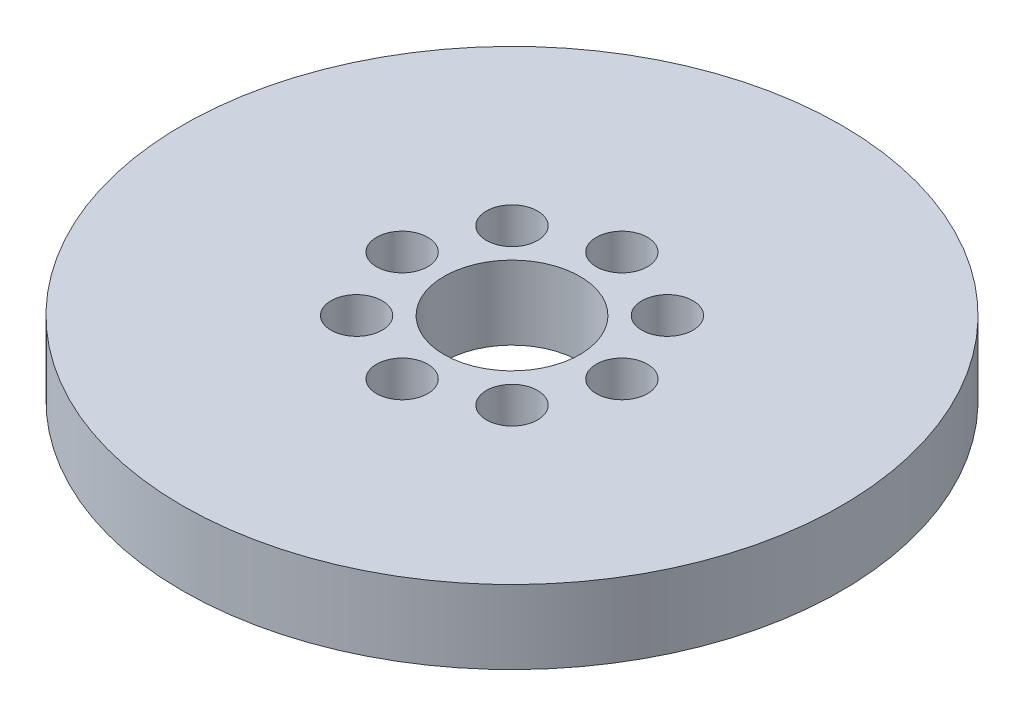
ISO-10303-21;
HEADER;
FILE_DESCRIPTION(('STEP AP214'),'2;1');
FILE_NAME('part.step','',(''),(''),'','','');
FILE_SCHEMA(('AUTOMOTIVE_DESIGN { 1 0 10303 214 1 1 1 1 }'));
ENDSEC;
DATA;
#1=APPLICATION_CONTEXT('core data for automotive mechanical design processes');
#2=APPLICATION_PROTOCOL_DEFINITION('international standard','automotive_design',2000,#1);
#3=PRODUCT_CONTEXT('',#1,'mechanical');
#4=PRODUCT('Part','Part','',(#3));
#5=PRODUCT_RELATED_PRODUCT_CATEGORY('part','',(#4));
#6=PRODUCT_DEFINITION_FORMATION('','',#4);
#7=PRODUCT_DEFINITION_CONTEXT('part definition',#1,'design');
#8=PRODUCT_DEFINITION('design','',#6,#7);
#9=PRODUCT_DEFINITION_SHAPE('','',#8);
#10=(LENGTH_UNIT() NAMED_UNIT(*) SI_UNIT(.MILLI.,.METRE.));
#11=(NAMED_UNIT(*) PLANE_ANGLE_UNIT() SI_UNIT($,.RADIAN.));
#12=(NAMED_UNIT(*) SI_UNIT($,.STERADIAN.) SOLID_ANGLE_UNIT());
#13=UNCERTAINTY_MEASURE_WITH_UNIT(LENGTH_MEASURE(1.E-05),#10,'distance_accuracy_value','');
#14=(GEOMETRIC_REPRESENTATION_CONTEXT(3) GLOBAL_UNCERTAINTY_ASSIGNED_CONTEXT((#13)) GLOBAL_UNIT_ASSIGNED_CONTEXT((#10,
#11,#12)) REPRESENTATION_CONTEXT('',''));
#15=CARTESIAN_POINT('',(0.,0.,0.));
#16=DIRECTION('',(0.,0.,1.));
#17=DIRECTION('',(1.,0.,0.));
#18=AXIS2_PLACEMENT_3D('',#15,#16,#17);
#19=CARTESIAN_POINT('',(0.,19.,0.));
#20=DIRECTION('',(0.,-1.,0.));
#21=DIRECTION('',(0.,0.,-1.));
#22=AXIS2_PLACEMENT_3D('',#19,#20,#21);
#23=CYLINDRICAL_SURFACE('',#22,85.);
#24=CARTESIAN_POINT('',(0.,19.,0.));
#25=DIRECTION('',(0.,1.,0.));
#26=DIRECTION('',(0.,0.,1.));
#27=AXIS2_PLACEMENT_3D('',#24,#25,#26);
#28=CIRCLE('',#27,85.);
#29=CARTESIAN_POINT('',(0.,19.,85.));
#30=VERTEX_POINT('',#29);
#31=EDGE_CURVE('E10',#30,#30,#28,.T.);
#32=ORIENTED_EDGE('',*,*,#31,.F.);
#33=EDGE_LOOP('',(#32));
#34=FACE_BOUND('',#33,.T.);
#35=CARTESIAN_POINT('',(0.,0.,0.));
#36=DIRECTION('',(0.,1.,0.));
#37=DIRECTION('',(0.,0.,1.));
#38=AXIS2_PLACEMENT_3D('',#35,#36,#37);
#39=CIRCLE('',#38,85.);
#40=CARTESIAN_POINT('',(0.,0.,85.));
#41=VERTEX_POINT('',#40);
#42=EDGE_CURVE('E37',#41,#41,#39,.T.);
#43=ORIENTED_EDGE('',*,*,#42,.T.);
#44=EDGE_LOOP('',(#43));
#45=FACE_BOUND('',#44,.T.);
#46=ADVANCED_FACE('F40',(#34,#45),#23,.T.);
#47=CARTESIAN_POINT('',(0.,19.,0.));
#48=DIRECTION('',(0.,1.,0.));
#49=DIRECTION('',(0.,0.,1.));
#50=AXIS2_PLACEMENT_3D('',#47,#48,#49);
#51=PLANE('',#50);
#52=CARTESIAN_POINT('',(0.,19.,28.3424785973487));
#53=DIRECTION('',(0.,1.,0.));
#54=DIRECTION('',(1.,0.,0.));
#55=AXIS2_PLACEMENT_3D('',#52,#53,#54);
#56=CIRCLE('',#55,6.60038307416893);
#57=CARTESIAN_POINT('',(6.60038307416903,19.,28.3424785973486));
#58=VERTEX_POINT('',#57);
#59=EDGE_CURVE('E88',#58,#58,#56,.T.);
#60=ORIENTED_EDGE('',*,*,#59,.F.);
#61=EDGE_LOOP('',(#60));
#62=FACE_BOUND('',#61,.T.);
#63=CARTESIAN_POINT('',(20.0411588118199,19.,20.0411588118197));
#64=DIRECTION('',(0.,1.,0.));
#65=DIRECTION('',(0.707106781186544,0.,-0.707106781186551));
#66=AXIS2_PLACEMENT_3D('',#63,#64,#65);
#67=CIRCLE('',#66,6.60038307416893);
#68=CARTESIAN_POINT('',(24.7083344419937,19.,15.3739831816459));
#69=VERTEX_POINT('',#68);
#70=EDGE_CURVE('E79',#69,#69,#67,.T.);
#71=ORIENTED_EDGE('',*,*,#70,.F.);
#72=EDGE_LOOP('',(#71));
#73=FACE_BOUND('',#72,.T.);
#74=CARTESIAN_POINT('',(28.3424785973487,19.,0.));
#75=DIRECTION('',(0.,1.,0.));
#76=DIRECTION('',(0.,0.,-1.));
#77=AXIS2_PLACEMENT_3D('',#74,#75,#76);
#78=CIRCLE('',#77,6.60038307416893);
#79=CARTESIAN_POINT('',(28.3424785973487,19.,-6.60038307416893));
#80=VERTEX_POINT('',#79);
#81=EDGE_CURVE('E74',#80,#80,#78,.T.);
#82=ORIENTED_EDGE('',*,*,#81,.F.);
#83=EDGE_LOOP('',(#82));
#84=FACE_BOUND('',#83,.T.);
#85=CARTESIAN_POINT('',(20.0411588118197,19.,-20.04115881182));
#86=DIRECTION('',(0.,1.,0.));
#87=DIRECTION('',(-0.707106781186554,0.,-0.707106781186541));
#88=AXIS2_PLACEMENT_3D('',#85,#86,#87);
#89=CIRCLE('',#88,6.60038307416893);
#90=CARTESIAN_POINT('',(15.3739831816459,19.,-24.7083344419937));
#91=VERTEX_POINT('',#90);
#92=EDGE_CURVE('E70',#91,#91,#89,.T.);
#93=ORIENTED_EDGE('',*,*,#92,.F.);
#94=EDGE_LOOP('',(#93));
#95=FACE_BOUND('',#94,.T.);
#96=CARTESIAN_POINT('',(-2.96871705357611E-13,19.,-28.3424785973487));
#97=DIRECTION('',(0.,1.,0.));
#98=DIRECTION('',(-1.,0.,0.));
#99=AXIS2_PLACEMENT_3D('',#96,#97,#98);
#100=CIRCLE('',#99,6.60038307416893);
#101=CARTESIAN_POINT('',(-6.60038307416923,19.,-28.3424785973486));
#102=VERTEX_POINT('',#101);
#103=EDGE_CURVE('E100',#102,#102,#100,.T.);
#104=ORIENTED_EDGE('',*,*,#103,.F.);
#105=EDGE_LOOP('',(#104));
#106=FACE_BOUND('',#105,.T.);
#107=CARTESIAN_POINT('',(-20.0411588118201,19.,-20.0411588118196));
#108=DIRECTION('',(0.,1.,0.));
#109=DIRECTION('',(-0.707106781186539,0.,0.707106781186556));
#110=AXIS2_PLACEMENT_3D('',#107,#108,#109);
#111=CIRCLE('',#110,6.60038307416893);
#112=CARTESIAN_POINT('',(-24.7083344419938,19.,-15.3739831816458));
#113=VERTEX_POINT('',#112);
#114=EDGE_CURVE('E93',#113,#113,#111,.T.);
#115=ORIENTED_EDGE('',*,*,#114,.F.);
#116=EDGE_LOOP('',(#115));
#117=FACE_BOUND('',#116,.T.);
#118=CARTESIAN_POINT('',(-20.0411588118198,19.,20.0411588118199));
#119=DIRECTION('',(0.,1.,0.));
#120=DIRECTION('',(0.707106781186549,0.,0.707106781186546));
#121=AXIS2_PLACEMENT_3D('',#118,#119,#120);
#122=CIRCLE('',#121,6.60038307416893);
#123=CARTESIAN_POINT('',(-15.373983181646,19.,24.7083344419936));
#124=VERTEX_POINT('',#123);
#125=EDGE_CURVE('E61',#124,#124,#122,.T.);
#126=ORIENTED_EDGE('',*,*,#125,.F.);
#127=EDGE_LOOP('',(#126));
#128=FACE_BOUND('',#127,.T.);
#129=CARTESIAN_POINT('',(-28.3424785973487,19.,0.));
#130=DIRECTION('',(0.,1.,0.));
#131=DIRECTION('',(0.,0.,1.));
#132=AXIS2_PLACEMENT_3D('',#129,#130,#131);
#133=CIRCLE('',#132,6.60038307416893);
#134=CARTESIAN_POINT('',(-28.3424785973487,19.,6.60038307416893));
#135=VERTEX_POINT('',#134);
#136=EDGE_CURVE('E54',#135,#135,#133,.T.);
#137=ORIENTED_EDGE('',*,*,#136,.F.);
#138=EDGE_LOOP('',(#137));
#139=FACE_BOUND('',#138,.T.);
#140=CARTESIAN_POINT('',(0.,19.,0.));
#141=DIRECTION('',(0.,1.,0.));
#142=DIRECTION('',(0.,0.,1.));
#143=AXIS2_PLACEMENT_3D('',#140,#141,#142);
#144=CIRCLE('',#143,17.5);
#145=CARTESIAN_POINT('',(0.,19.,17.5));
#146=VERTEX_POINT('',#145);
#147=EDGE_CURVE('E50',#146,#146,#144,.T.);
#148=ORIENTED_EDGE('',*,*,#147,.F.);
#149=EDGE_LOOP('',(#148));
#150=FACE_BOUND('',#149,.T.);
#151=ORIENTED_EDGE('',*,*,#31,.T.);
#152=EDGE_LOOP('',(#151));
#153=FACE_BOUND('',#152,.T.);
#154=ADVANCED_FACE('F115',(#62,#73,#84,#95,#106,#117,#128,#139,#150,#153),#51,.T.);
#155=CARTESIAN_POINT('',(0.,0.,0.));
#156=DIRECTION('',(0.,1.,0.));
#157=DIRECTION('',(0.,0.,1.));
#158=AXIS2_PLACEMENT_3D('',#155,#156,#157);
#159=PLANE('',#158);
#160=CARTESIAN_POINT('',(0.,0.,0.));
#161=DIRECTION('',(0.,1.,0.));
#162=DIRECTION('',(0.,0.,1.));
#163=AXIS2_PLACEMENT_3D('',#160,#161,#162);
#164=CIRCLE('',#163,17.5);
#165=CARTESIAN_POINT('',(0.,0.,17.5));
#166=VERTEX_POINT('',#165);
#167=EDGE_CURVE('E47',#166,#166,#164,.T.);
#168=ORIENTED_EDGE('',*,*,#167,.T.);
#169=EDGE_LOOP('',(#168));
#170=FACE_BOUND('',#169,.T.);
#171=ORIENTED_EDGE('',*,*,#42,.F.);
#172=EDGE_LOOP('',(#171));
#173=FACE_BOUND('',#172,.T.);
#174=ADVANCED_FACE('F113',(#170,#173),#159,.F.);
#175=CARTESIAN_POINT('',(0.,19.,0.));
#176=DIRECTION('',(0.,-1.,0.));
#177=DIRECTION('',(0.,0.,-1.));
#178=AXIS2_PLACEMENT_3D('',#175,#176,#177);
#179=CYLINDRICAL_SURFACE('',#178,17.5);
#180=ORIENTED_EDGE('',*,*,#147,.T.);
#181=EDGE_LOOP('',(#180));
#182=FACE_BOUND('',#181,.T.);
#183=ORIENTED_EDGE('',*,*,#167,.F.);
#184=EDGE_LOOP('',(#183));
#185=FACE_BOUND('',#184,.T.);
#186=ADVANCED_FACE('F127',(#182,#185),#179,.F.);
#187=CARTESIAN_POINT('',(-28.3424785973487,6.29484868787648,0.));
#188=DIRECTION('',(0.,1.,0.));
#189=DIRECTION('',(0.,0.,1.));
#190=AXIS2_PLACEMENT_3D('',#187,#188,#189);
#191=CYLINDRICAL_SURFACE('',#190,6.60038307416893);
#192=CARTESIAN_POINT('',(-28.3424785973487,6.29484868787648,0.));
#193=DIRECTION('',(0.,1.,0.));
#194=DIRECTION('',(0.,0.,1.));
#195=AXIS2_PLACEMENT_3D('',#192,#193,#194);
#196=CIRCLE('',#195,6.60038307416893);
#197=CARTESIAN_POINT('',(-28.3424785973487,6.29484868787648,6.60038307416893));
#198=VERTEX_POINT('',#197);
#199=EDGE_CURVE('E55',#198,#198,#196,.T.);
#200=ORIENTED_EDGE('',*,*,#199,.F.);
#201=EDGE_LOOP('',(#200));
#202=FACE_BOUND('',#201,.T.);
#203=ORIENTED_EDGE('',*,*,#136,.T.);
#204=EDGE_LOOP('',(#203));
#205=FACE_BOUND('',#204,.T.);
#206=ADVANCED_FACE('F129',(#202,#205),#191,.F.);
#207=CARTESIAN_POINT('',(-28.3424785973487,6.29484868787648,0.));
#208=DIRECTION('',(0.,1.,0.));
#209=DIRECTION('',(0.,0.,1.));
#210=AXIS2_PLACEMENT_3D('',#207,#208,#209);
#211=PLANE('',#210);
#212=ORIENTED_EDGE('',*,*,#199,.T.);
#213=EDGE_LOOP('',(#212));
#214=FACE_BOUND('',#213,.T.);
#215=ADVANCED_FACE('F157',(#214),#211,.T.);
#216=CARTESIAN_POINT('',(-20.0411588118198,6.29484868787648,20.0411588118199));
#217=DIRECTION('',(0.,1.,0.));
#218=DIRECTION('',(0.,0.,1.));
#219=AXIS2_PLACEMENT_3D('',#216,#217,#218);
#220=CYLINDRICAL_SURFACE('',#219,6.60038307416893);
#221=CARTESIAN_POINT('',(-20.0411588118198,6.29484868787648,20.0411588118199));
#222=DIRECTION('',(0.,1.,0.));
#223=DIRECTION('',(0.707106781186549,0.,0.707106781186546));
#224=AXIS2_PLACEMENT_3D('',#221,#222,#223);
#225=CIRCLE('',#224,6.60038307416893);
#226=CARTESIAN_POINT('',(-15.373983181646,6.29484868787648,24.7083344419936));
#227=VERTEX_POINT('',#226);
#228=EDGE_CURVE('E59',#227,#227,#225,.T.);
#229=ORIENTED_EDGE('',*,*,#228,.F.);
#230=EDGE_LOOP('',(#229));
#231=FACE_BOUND('',#230,.T.);
#232=ORIENTED_EDGE('',*,*,#125,.T.);
#233=EDGE_LOOP('',(#232));
#234=FACE_BOUND('',#233,.T.);
#235=ADVANCED_FACE('F170',(#231,#234),#220,.F.);
#236=CARTESIAN_POINT('',(-20.0411588118198,6.29484868787648,20.0411588118199));
#237=DIRECTION('',(0.,1.,0.));
#238=DIRECTION('',(0.707106781186549,0.,0.707106781186546));
#239=AXIS2_PLACEMENT_3D('',#236,#237,#238);
#240=PLANE('',#239);
#241=ORIENTED_EDGE('',*,*,#228,.T.);
#242=EDGE_LOOP('',(#241));
#243=FACE_BOUND('',#242,.T.);
#244=ADVANCED_FACE('F182',(#243),#240,.T.);
#245=CARTESIAN_POINT('',(-20.0411588118201,6.29484868787648,-20.0411588118196));
#246=DIRECTION('',(0.,1.,0.));
#247=DIRECTION('',(0.,0.,1.));
#248=AXIS2_PLACEMENT_3D('',#245,#246,#247);
#249=CYLINDRICAL_SURFACE('',#248,6.60038307416893);
#250=CARTESIAN_POINT('',(-20.0411588118201,6.29484868787648,-20.0411588118196));
#251=DIRECTION('',(0.,1.,0.));
#252=DIRECTION('',(-0.707106781186539,0.,0.707106781186556));
#253=AXIS2_PLACEMENT_3D('',#250,#251,#252);
#254=CIRCLE('',#253,6.60038307416893);
#255=CARTESIAN_POINT('',(-24.7083344419938,6.29484868787648,-15.3739831816458));
#256=VERTEX_POINT('',#255);
#257=EDGE_CURVE('E94',#256,#256,#254,.T.);
#258=ORIENTED_EDGE('',*,*,#257,.F.);
#259=EDGE_LOOP('',(#258));
#260=FACE_BOUND('',#259,.T.);
#261=ORIENTED_EDGE('',*,*,#114,.T.);
#262=EDGE_LOOP('',(#261));
#263=FACE_BOUND('',#262,.T.);
#264=ADVANCED_FACE('F189',(#260,#263),#249,.F.);
#265=CARTESIAN_POINT('',(-20.0411588118201,6.29484868787648,-20.0411588118196));
#266=DIRECTION('',(0.,1.,0.));
#267=DIRECTION('',(-0.707106781186539,0.,0.707106781186556));
#268=AXIS2_PLACEMENT_3D('',#265,#266,#267);
#269=PLANE('',#268);
#270=ORIENTED_EDGE('',*,*,#257,.T.);
#271=EDGE_LOOP('',(#270));
#272=FACE_BOUND('',#271,.T.);
#273=ADVANCED_FACE('F107',(#272),#269,.T.);
#274=CARTESIAN_POINT('',(-2.96871705357611E-13,6.29484868787648,-28.3424785973487));
#275=DIRECTION('',(0.,1.,0.));
#276=DIRECTION('',(0.,0.,1.));
#277=AXIS2_PLACEMENT_3D('',#274,#275,#276);
#278=CYLINDRICAL_SURFACE('',#277,6.60038307416893);
#279=CARTESIAN_POINT('',(-2.96871705357611E-13,6.29484868787648,-28.3424785973487));
#280=DIRECTION('',(0.,1.,0.));
#281=DIRECTION('',(-1.,0.,0.));
#282=AXIS2_PLACEMENT_3D('',#279,#280,#281);
#283=CIRCLE('',#282,6.60038307416893);
#284=CARTESIAN_POINT('',(-6.60038307416923,6.29484868787648,-28.3424785973486));
#285=VERTEX_POINT('',#284);
#286=EDGE_CURVE('E72',#285,#285,#283,.T.);
#287=ORIENTED_EDGE('',*,*,#286,.F.);
#288=EDGE_LOOP('',(#287));
#289=FACE_BOUND('',#288,.T.);
#290=ORIENTED_EDGE('',*,*,#103,.T.);
#291=EDGE_LOOP('',(#290));
#292=FACE_BOUND('',#291,.T.);
#293=ADVANCED_FACE('F104',(#289,#292),#278,.F.);
#294=CARTESIAN_POINT('',(-2.96871705357611E-13,6.29484868787648,-28.3424785973487));
#295=DIRECTION('',(0.,1.,0.));
#296=DIRECTION('',(-1.,0.,0.));
#297=AXIS2_PLACEMENT_3D('',#294,#295,#296);
#298=PLANE('',#297);
#299=ORIENTED_EDGE('',*,*,#286,.T.);
#300=EDGE_LOOP('',(#299));
#301=FACE_BOUND('',#300,.T.);
#302=ADVANCED_FACE('F103',(#301),#298,.T.);
#303=CARTESIAN_POINT('',(20.0411588118197,6.29484868787648,-20.04115881182));
#304=DIRECTION('',(0.,1.,0.));
#305=DIRECTION('',(0.,0.,1.));
#306=AXIS2_PLACEMENT_3D('',#303,#304,#305);
#307=CYLINDRICAL_SURFACE('',#306,6.60038307416893);
#308=CARTESIAN_POINT('',(20.0411588118197,6.29484868787648,-20.04115881182));
#309=DIRECTION('',(0.,1.,0.));
#310=DIRECTION('',(-0.707106781186554,0.,-0.707106781186541));
#311=AXIS2_PLACEMENT_3D('',#308,#309,#310);
#312=CIRCLE('',#311,6.60038307416893);
#313=CARTESIAN_POINT('',(15.3739831816459,6.29484868787648,-24.7083344419937));
#314=VERTEX_POINT('',#313);
#315=EDGE_CURVE('E69',#314,#314,#312,.T.);
#316=ORIENTED_EDGE('',*,*,#315,.F.);
#317=EDGE_LOOP('',(#316));
#318=FACE_BOUND('',#317,.T.);
#319=ORIENTED_EDGE('',*,*,#92,.T.);
#320=EDGE_LOOP('',(#319));
#321=FACE_BOUND('',#320,.T.);
#322=ADVANCED_FACE('F219',(#318,#321),#307,.F.);
#323=CARTESIAN_POINT('',(20.0411588118197,6.29484868787648,-20.04115881182));
#324=DIRECTION('',(0.,1.,0.));
#325=DIRECTION('',(-0.707106781186554,0.,-0.707106781186541));
#326=AXIS2_PLACEMENT_3D('',#323,#324,#325);
#327=PLANE('',#326);
#328=ORIENTED_EDGE('',*,*,#315,.T.);
#329=EDGE_LOOP('',(#328));
#330=FACE_BOUND('',#329,.T.);
#331=ADVANCED_FACE('F227',(#330),#327,.T.);
#332=CARTESIAN_POINT('',(28.3424785973487,6.29484868787648,0.));
#333=DIRECTION('',(0.,1.,0.));
#334=DIRECTION('',(0.,0.,1.));
#335=AXIS2_PLACEMENT_3D('',#332,#333,#334);
#336=CYLINDRICAL_SURFACE('',#335,6.60038307416893);
#337=CARTESIAN_POINT('',(28.3424785973487,6.29484868787648,0.));
#338=DIRECTION('',(0.,1.,0.));
#339=DIRECTION('',(0.,0.,-1.));
#340=AXIS2_PLACEMENT_3D('',#337,#338,#339);
#341=CIRCLE('',#340,6.60038307416893);
#342=CARTESIAN_POINT('',(28.3424785973487,6.29484868787648,-6.60038307416893));
#343=VERTEX_POINT('',#342);
#344=EDGE_CURVE('E80',#343,#343,#341,.T.);
#345=ORIENTED_EDGE('',*,*,#344,.F.);
#346=EDGE_LOOP('',(#345));
#347=FACE_BOUND('',#346,.T.);
#348=ORIENTED_EDGE('',*,*,#81,.T.);
#349=EDGE_LOOP('',(#348));
#350=FACE_BOUND('',#349,.T.);
#351=ADVANCED_FACE('F240',(#347,#350),#336,.F.);
#352=CARTESIAN_POINT('',(28.3424785973487,6.29484868787648,0.));
#353=DIRECTION('',(0.,1.,0.));
#354=DIRECTION('',(0.,0.,-1.));
#355=AXIS2_PLACEMENT_3D('',#352,#353,#354);
#356=PLANE('',#355);
#357=ORIENTED_EDGE('',*,*,#344,.T.);
#358=EDGE_LOOP('',(#357));
#359=FACE_BOUND('',#358,.T.);
#360=ADVANCED_FACE('F246',(#359),#356,.T.);
#361=CARTESIAN_POINT('',(20.0411588118199,6.29484868787648,20.0411588118197));
#362=DIRECTION('',(0.,1.,0.));
#363=DIRECTION('',(0.,0.,1.));
#364=AXIS2_PLACEMENT_3D('',#361,#362,#363);
#365=CYLINDRICAL_SURFACE('',#364,6.60038307416893);
#366=CARTESIAN_POINT('',(20.0411588118199,6.29484868787648,20.0411588118197));
#367=DIRECTION('',(0.,1.,0.));
#368=DIRECTION('',(0.707106781186544,0.,-0.707106781186551));
#369=AXIS2_PLACEMENT_3D('',#366,#367,#368);
#370=CIRCLE('',#369,6.60038307416893);
#371=CARTESIAN_POINT('',(24.7083344419937,6.29484868787648,15.3739831816459));
#372=VERTEX_POINT('',#371);
#373=EDGE_CURVE('E82',#372,#372,#370,.T.);
#374=ORIENTED_EDGE('',*,*,#373,.F.);
#375=EDGE_LOOP('',(#374));
#376=FACE_BOUND('',#375,.T.);
#377=ORIENTED_EDGE('',*,*,#70,.T.);
#378=EDGE_LOOP('',(#377));
#379=FACE_BOUND('',#378,.T.);
#380=ADVANCED_FACE('F254',(#376,#379),#365,.F.);
#381=CARTESIAN_POINT('',(20.0411588118199,6.29484868787648,20.0411588118197));
#382=DIRECTION('',(0.,1.,0.));
#383=DIRECTION('',(0.707106781186544,0.,-0.707106781186551));
#384=AXIS2_PLACEMENT_3D('',#381,#382,#383);
#385=PLANE('',#384);
#386=ORIENTED_EDGE('',*,*,#373,.T.);
#387=EDGE_LOOP('',(#386));
#388=FACE_BOUND('',#387,.T.);
#389=ADVANCED_FACE('F262',(#388),#385,.T.);
#390=CARTESIAN_POINT('',(0.,6.29484868787648,28.3424785973487));
#391=DIRECTION('',(0.,1.,0.));
#392=DIRECTION('',(0.,0.,1.));
#393=AXIS2_PLACEMENT_3D('',#390,#391,#392);
#394=CYLINDRICAL_SURFACE('',#393,6.60038307416893);
#395=CARTESIAN_POINT('',(0.,6.29484868787648,28.3424785973487));
#396=DIRECTION('',(0.,1.,0.));
#397=DIRECTION('',(1.,0.,0.));
#398=AXIS2_PLACEMENT_3D('',#395,#396,#397);
#399=CIRCLE('',#398,6.60038307416893);
#400=CARTESIAN_POINT('',(6.60038307416903,6.29484868787648,28.3424785973486));
#401=VERTEX_POINT('',#400);
#402=EDGE_CURVE('E63',#401,#401,#399,.T.);
#403=ORIENTED_EDGE('',*,*,#402,.F.);
#404=EDGE_LOOP('',(#403));
#405=FACE_BOUND('',#404,.T.);
#406=ORIENTED_EDGE('',*,*,#59,.T.);
#407=EDGE_LOOP('',(#406));
#408=FACE_BOUND('',#407,.T.);
#409=ADVANCED_FACE('F272',(#405,#408),#394,.F.);
#410=CARTESIAN_POINT('',(0.,6.29484868787648,28.3424785973487));
#411=DIRECTION('',(0.,1.,0.));
#412=DIRECTION('',(1.,0.,0.));
#413=AXIS2_PLACEMENT_3D('',#410,#411,#412);
#414=PLANE('',#413);
#415=ORIENTED_EDGE('',*,*,#402,.T.);
#416=EDGE_LOOP('',(#415));
#417=FACE_BOUND('',#416,.T.);
#418=ADVANCED_FACE('F285',(#417),#414,.T.);
#419=CLOSED_SHELL('',(#46,#154,#174,#186,#206,#215,#235,#244,#264,#273,#293,#302,#322,#331,#351,
#360,#380,#389,#409,#418));
#420=MANIFOLD_SOLID_BREP('B2',#419);
#421=ADVANCED_BREP_SHAPE_REPRESENTATION('',(#18,#420),#14);
#422=SHAPE_DEFINITION_REPRESENTATION(#9,#421);
ENDSEC;
END-ISO-10303-21;
